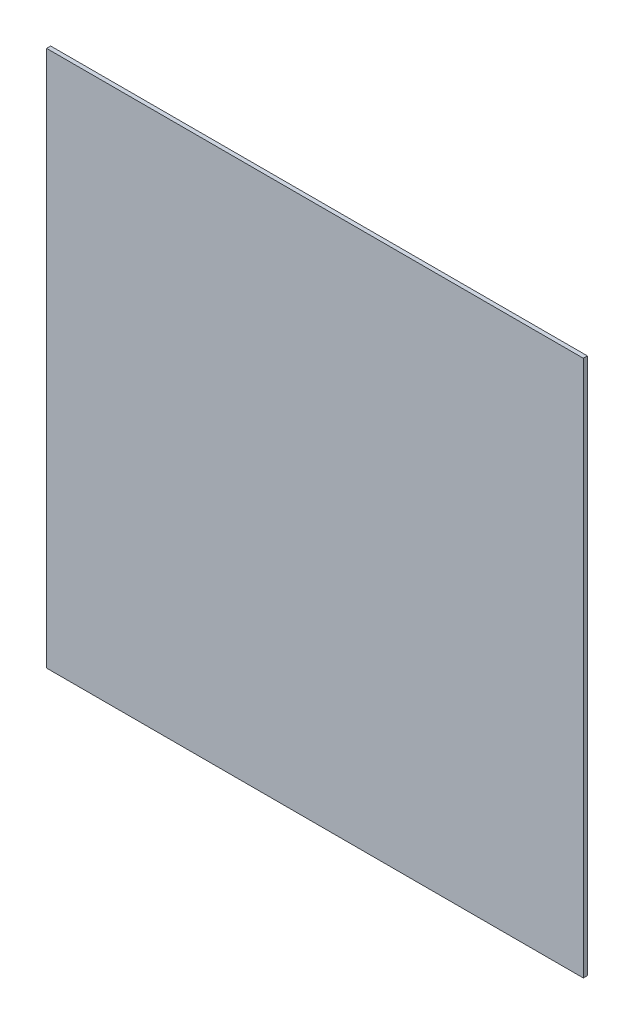
ISO-10303-21;
HEADER;
FILE_DESCRIPTION(('STEP AP214'),'2;1');
FILE_NAME('part.step','',(''),(''),'','','');
FILE_SCHEMA(('AUTOMOTIVE_DESIGN { 1 0 10303 214 1 1 1 1 }'));
ENDSEC;
DATA;
#1=APPLICATION_CONTEXT('core data for automotive mechanical design processes');
#2=APPLICATION_PROTOCOL_DEFINITION('international standard','automotive_design',2000,#1);
#3=PRODUCT_CONTEXT('',#1,'mechanical');
#4=PRODUCT('Part','Part','',(#3));
#5=PRODUCT_RELATED_PRODUCT_CATEGORY('part','',(#4));
#6=PRODUCT_DEFINITION_FORMATION('','',#4);
#7=PRODUCT_DEFINITION_CONTEXT('part definition',#1,'design');
#8=PRODUCT_DEFINITION('design','',#6,#7);
#9=PRODUCT_DEFINITION_SHAPE('','',#8);
#10=(LENGTH_UNIT() NAMED_UNIT(*) SI_UNIT(.MILLI.,.METRE.));
#11=(NAMED_UNIT(*) PLANE_ANGLE_UNIT() SI_UNIT($,.RADIAN.));
#12=(NAMED_UNIT(*) SI_UNIT($,.STERADIAN.) SOLID_ANGLE_UNIT());
#13=UNCERTAINTY_MEASURE_WITH_UNIT(LENGTH_MEASURE(1.E-05),#10,'distance_accuracy_value','');
#14=(GEOMETRIC_REPRESENTATION_CONTEXT(3) GLOBAL_UNCERTAINTY_ASSIGNED_CONTEXT((#13)) GLOBAL_UNIT_ASSIGNED_CONTEXT((#10,
#11,#12)) REPRESENTATION_CONTEXT('',''));
#15=CARTESIAN_POINT('',(0.,0.,0.));
#16=DIRECTION('',(0.,0.,1.));
#17=DIRECTION('',(1.,0.,0.));
#18=AXIS2_PLACEMENT_3D('',#15,#16,#17);
#19=CARTESIAN_POINT('',(197.,197.,0.));
#20=DIRECTION('',(0.,0.,1.));
#21=DIRECTION('',(1.,0.,0.));
#22=AXIS2_PLACEMENT_3D('',#19,#20,#21);
#23=PLANE('',#22);
#24=DIRECTION('',(0.,1.,0.));
#25=VECTOR('',#24,1.);
#26=CARTESIAN_POINT('',(0.,394.,0.));
#27=LINE('',#26,#25);
#28=CARTESIAN_POINT('',(0.,394.,0.));
#29=VERTEX_POINT('',#28);
#30=CARTESIAN_POINT('',(0.,0.,0.));
#31=VERTEX_POINT('',#30);
#32=EDGE_CURVE('E86',#29,#31,#27,.F.);
#33=ORIENTED_EDGE('',*,*,#32,.F.);
#34=DIRECTION('',(1.,0.,0.));
#35=VECTOR('',#34,1.);
#36=CARTESIAN_POINT('',(394.,394.,0.));
#37=LINE('',#36,#35);
#38=CARTESIAN_POINT('',(394.,394.,0.));
#39=VERTEX_POINT('',#38);
#40=EDGE_CURVE('E56',#39,#29,#37,.F.);
#41=ORIENTED_EDGE('',*,*,#40,.F.);
#42=DIRECTION('',(0.,1.,0.));
#43=VECTOR('',#42,1.);
#44=CARTESIAN_POINT('',(394.,0.,0.));
#45=LINE('',#44,#43);
#46=CARTESIAN_POINT('',(394.,0.,0.));
#47=VERTEX_POINT('',#46);
#48=EDGE_CURVE('E58',#47,#39,#45,.T.);
#49=ORIENTED_EDGE('',*,*,#48,.F.);
#50=DIRECTION('',(1.,0.,0.));
#51=VECTOR('',#50,1.);
#52=CARTESIAN_POINT('',(0.,0.,0.));
#53=LINE('',#52,#51);
#54=EDGE_CURVE('E20',#31,#47,#53,.T.);
#55=ORIENTED_EDGE('',*,*,#54,.F.);
#56=EDGE_LOOP('',(#33,#41,#49,#55));
#57=FACE_BOUND('',#56,.T.);
#58=ADVANCED_FACE('F17',(#57),#23,.F.);
#59=CARTESIAN_POINT('',(0.,0.,0.));
#60=DIRECTION('',(0.,-1.,0.));
#61=DIRECTION('',(0.,0.,-1.));
#62=AXIS2_PLACEMENT_3D('',#59,#60,#61);
#63=PLANE('',#62);
#64=DIRECTION('',(1.,0.,0.));
#65=VECTOR('',#64,1.);
#66=CARTESIAN_POINT('',(197.,0.,3.));
#67=LINE('',#66,#65);
#68=CARTESIAN_POINT('',(0.,0.,3.));
#69=VERTEX_POINT('',#68);
#70=CARTESIAN_POINT('',(394.,0.,3.));
#71=VERTEX_POINT('',#70);
#72=EDGE_CURVE('E93',#69,#71,#67,.T.);
#73=ORIENTED_EDGE('',*,*,#72,.F.);
#74=DIRECTION('',(0.,0.,1.));
#75=VECTOR('',#74,1.);
#76=CARTESIAN_POINT('',(0.,0.,0.));
#77=LINE('',#76,#75);
#78=EDGE_CURVE('E70',#31,#69,#77,.T.);
#79=ORIENTED_EDGE('',*,*,#78,.F.);
#80=ORIENTED_EDGE('',*,*,#54,.T.);
#81=DIRECTION('',(0.,0.,-1.));
#82=VECTOR('',#81,1.);
#83=CARTESIAN_POINT('',(394.,0.,0.));
#84=LINE('',#83,#82);
#85=EDGE_CURVE('E65',#71,#47,#84,.T.);
#86=ORIENTED_EDGE('',*,*,#85,.F.);
#87=EDGE_LOOP('',(#73,#79,#80,#86));
#88=FACE_BOUND('',#87,.T.);
#89=ADVANCED_FACE('F67',(#88),#63,.T.);
#90=CARTESIAN_POINT('',(394.,0.,0.));
#91=DIRECTION('',(1.,0.,0.));
#92=DIRECTION('',(0.,0.,-1.));
#93=AXIS2_PLACEMENT_3D('',#90,#91,#92);
#94=PLANE('',#93);
#95=DIRECTION('',(0.,1.,0.));
#96=VECTOR('',#95,1.);
#97=CARTESIAN_POINT('',(394.,197.,3.));
#98=LINE('',#97,#96);
#99=CARTESIAN_POINT('',(394.,394.,3.));
#100=VERTEX_POINT('',#99);
#101=EDGE_CURVE('E75',#71,#100,#98,.T.);
#102=ORIENTED_EDGE('',*,*,#101,.F.);
#103=ORIENTED_EDGE('',*,*,#85,.T.);
#104=ORIENTED_EDGE('',*,*,#48,.T.);
#105=DIRECTION('',(0.,0.,1.));
#106=VECTOR('',#105,1.);
#107=CARTESIAN_POINT('',(394.,394.,0.));
#108=LINE('',#107,#106);
#109=EDGE_CURVE('E81',#100,#39,#108,.F.);
#110=ORIENTED_EDGE('',*,*,#109,.F.);
#111=EDGE_LOOP('',(#102,#103,#104,#110));
#112=FACE_BOUND('',#111,.T.);
#113=ADVANCED_FACE('F73',(#112),#94,.T.);
#114=CARTESIAN_POINT('',(394.,394.,0.));
#115=DIRECTION('',(0.,1.,0.));
#116=DIRECTION('',(0.,0.,1.));
#117=AXIS2_PLACEMENT_3D('',#114,#115,#116);
#118=PLANE('',#117);
#119=DIRECTION('',(1.,0.,0.));
#120=VECTOR('',#119,1.);
#121=CARTESIAN_POINT('',(197.,394.,3.));
#122=LINE('',#121,#120);
#123=CARTESIAN_POINT('',(0.,394.,3.));
#124=VERTEX_POINT('',#123);
#125=EDGE_CURVE('E27',#100,#124,#122,.F.);
#126=ORIENTED_EDGE('',*,*,#125,.F.);
#127=ORIENTED_EDGE('',*,*,#109,.T.);
#128=ORIENTED_EDGE('',*,*,#40,.T.);
#129=DIRECTION('',(0.,0.,1.));
#130=VECTOR('',#129,1.);
#131=CARTESIAN_POINT('',(0.,394.,0.));
#132=LINE('',#131,#130);
#133=EDGE_CURVE('E36',#124,#29,#132,.F.);
#134=ORIENTED_EDGE('',*,*,#133,.F.);
#135=EDGE_LOOP('',(#126,#127,#128,#134));
#136=FACE_BOUND('',#135,.T.);
#137=ADVANCED_FACE('F102',(#136),#118,.T.);
#138=CARTESIAN_POINT('',(0.,394.,0.));
#139=DIRECTION('',(-1.,0.,0.));
#140=DIRECTION('',(0.,0.,1.));
#141=AXIS2_PLACEMENT_3D('',#138,#139,#140);
#142=PLANE('',#141);
#143=DIRECTION('',(0.,1.,0.));
#144=VECTOR('',#143,1.);
#145=CARTESIAN_POINT('',(0.,197.,3.));
#146=LINE('',#145,#144);
#147=EDGE_CURVE('E11',#124,#69,#146,.F.);
#148=ORIENTED_EDGE('',*,*,#147,.F.);
#149=ORIENTED_EDGE('',*,*,#133,.T.);
#150=ORIENTED_EDGE('',*,*,#32,.T.);
#151=ORIENTED_EDGE('',*,*,#78,.T.);
#152=EDGE_LOOP('',(#148,#149,#150,#151));
#153=FACE_BOUND('',#152,.T.);
#154=ADVANCED_FACE('F104',(#153),#142,.T.);
#155=CARTESIAN_POINT('',(197.,197.,3.));
#156=DIRECTION('',(0.,0.,1.));
#157=DIRECTION('',(1.,0.,0.));
#158=AXIS2_PLACEMENT_3D('',#155,#156,#157);
#159=PLANE('',#158);
#160=ORIENTED_EDGE('',*,*,#125,.T.);
#161=ORIENTED_EDGE('',*,*,#147,.T.);
#162=ORIENTED_EDGE('',*,*,#72,.T.);
#163=ORIENTED_EDGE('',*,*,#101,.T.);
#164=EDGE_LOOP('',(#160,#161,#162,#163));
#165=FACE_BOUND('',#164,.T.);
#166=ADVANCED_FACE('F101',(#165),#159,.T.);
#167=CLOSED_SHELL('',(#58,#89,#113,#137,#154,#166));
#168=MANIFOLD_SOLID_BREP('B1',#167);
#169=ADVANCED_BREP_SHAPE_REPRESENTATION('',(#18,#168),#14);
#170=SHAPE_DEFINITION_REPRESENTATION(#9,#169);
ENDSEC;
END-ISO-10303-21;
